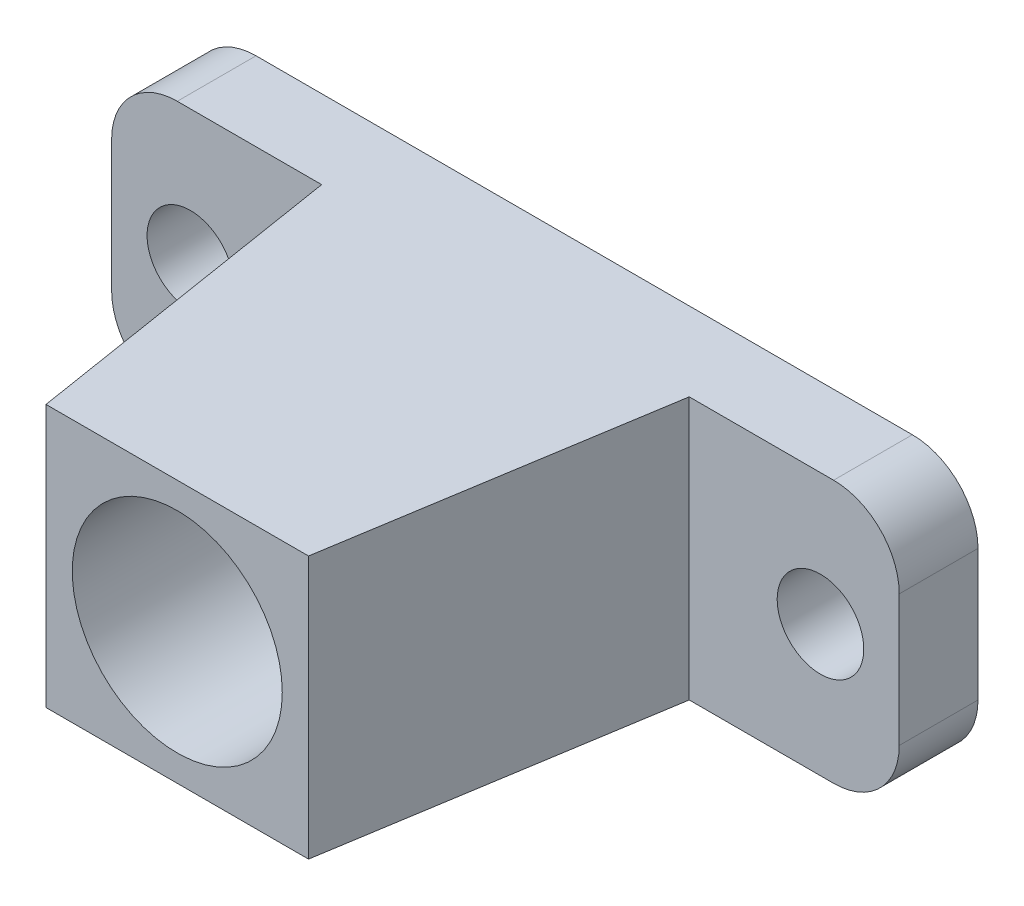
ISO-10303-21;
HEADER;
FILE_DESCRIPTION(('STEP AP214'),'2;1');
FILE_NAME('part.step','',(''),(''),'','','');
FILE_SCHEMA(('AUTOMOTIVE_DESIGN { 1 0 10303 214 1 1 1 1 }'));
ENDSEC;
DATA;
#1=APPLICATION_CONTEXT('core data for automotive mechanical design processes');
#2=APPLICATION_PROTOCOL_DEFINITION('international standard','automotive_design',2000,#1);
#3=PRODUCT_CONTEXT('',#1,'mechanical');
#4=PRODUCT('Part','Part','',(#3));
#5=PRODUCT_RELATED_PRODUCT_CATEGORY('part','',(#4));
#6=PRODUCT_DEFINITION_FORMATION('','',#4);
#7=PRODUCT_DEFINITION_CONTEXT('part definition',#1,'design');
#8=PRODUCT_DEFINITION('design','',#6,#7);
#9=PRODUCT_DEFINITION_SHAPE('','',#8);
#10=(LENGTH_UNIT() NAMED_UNIT(*) SI_UNIT(.MILLI.,.METRE.));
#11=(NAMED_UNIT(*) PLANE_ANGLE_UNIT() SI_UNIT($,.RADIAN.));
#12=(NAMED_UNIT(*) SI_UNIT($,.STERADIAN.) SOLID_ANGLE_UNIT());
#13=UNCERTAINTY_MEASURE_WITH_UNIT(LENGTH_MEASURE(1.E-05),#10,'distance_accuracy_value','');
#14=(GEOMETRIC_REPRESENTATION_CONTEXT(3) GLOBAL_UNCERTAINTY_ASSIGNED_CONTEXT((#13)) GLOBAL_UNIT_ASSIGNED_CONTEXT((#10,
#11,#12)) REPRESENTATION_CONTEXT('',''));
#15=CARTESIAN_POINT('',(0.,0.,0.));
#16=DIRECTION('',(0.,0.,1.));
#17=DIRECTION('',(1.,0.,0.));
#18=AXIS2_PLACEMENT_3D('',#15,#16,#17);
#19=CARTESIAN_POINT('',(25.,5.,6.));
#20=DIRECTION('',(0.,0.,-1.));
#21=DIRECTION('',(-1.,0.,0.));
#22=AXIS2_PLACEMENT_3D('',#19,#20,#21);
#23=PLANE('',#22);
#24=CARTESIAN_POINT('',(24.,0.,6.));
#25=DIRECTION('',(0.,0.,1.));
#26=DIRECTION('',(-1.,0.,0.));
#27=AXIS2_PLACEMENT_3D('',#24,#25,#26);
#28=CIRCLE('',#27,3.3);
#29=CARTESIAN_POINT('',(20.7,0.,6.));
#30=VERTEX_POINT('',#29);
#31=EDGE_CURVE('E166',#30,#30,#28,.T.);
#32=ORIENTED_EDGE('',*,*,#31,.F.);
#33=EDGE_LOOP('',(#32));
#34=FACE_BOUND('',#33,.T.);
#35=DIRECTION('',(0.,1.,0.));
#36=VECTOR('',#35,1.);
#37=CARTESIAN_POINT('',(14.,-47.5366487582469,6.));
#38=LINE('',#37,#36);
#39=CARTESIAN_POINT('',(14.,-10.,6.));
#40=VERTEX_POINT('',#39);
#41=CARTESIAN_POINT('',(14.,10.,6.));
#42=VERTEX_POINT('',#41);
#43=EDGE_CURVE('E50',#40,#42,#38,.T.);
#44=ORIENTED_EDGE('',*,*,#43,.F.);
#45=DIRECTION('',(1.,0.,0.));
#46=VECTOR('',#45,1.);
#47=CARTESIAN_POINT('',(25.,-10.,6.));
#48=LINE('',#47,#46);
#49=CARTESIAN_POINT('',(25.,-10.,6.));
#50=VERTEX_POINT('',#49);
#51=EDGE_CURVE('E190',#40,#50,#48,.T.);
#52=ORIENTED_EDGE('',*,*,#51,.T.);
#53=CARTESIAN_POINT('',(25.,-5.,6.));
#54=DIRECTION('',(0.,0.,1.));
#55=DIRECTION('',(-1.,0.,0.));
#56=AXIS2_PLACEMENT_3D('',#53,#54,#55);
#57=CIRCLE('',#56,5.);
#58=CARTESIAN_POINT('',(30.,-5.,6.));
#59=VERTEX_POINT('',#58);
#60=EDGE_CURVE('E192',#50,#59,#57,.T.);
#61=ORIENTED_EDGE('',*,*,#60,.T.);
#62=DIRECTION('',(0.,1.,0.));
#63=VECTOR('',#62,1.);
#64=CARTESIAN_POINT('',(30.,5.,6.));
#65=LINE('',#64,#63);
#66=CARTESIAN_POINT('',(30.,5.,6.));
#67=VERTEX_POINT('',#66);
#68=EDGE_CURVE('E194',#59,#67,#65,.T.);
#69=ORIENTED_EDGE('',*,*,#68,.T.);
#70=CARTESIAN_POINT('',(25.,5.,6.));
#71=DIRECTION('',(0.,0.,1.));
#72=DIRECTION('',(-1.,0.,0.));
#73=AXIS2_PLACEMENT_3D('',#70,#71,#72);
#74=CIRCLE('',#73,5.);
#75=CARTESIAN_POINT('',(25.,10.,6.));
#76=VERTEX_POINT('',#75);
#77=EDGE_CURVE('E178',#67,#76,#74,.T.);
#78=ORIENTED_EDGE('',*,*,#77,.T.);
#79=DIRECTION('',(-1.,0.,0.));
#80=VECTOR('',#79,1.);
#81=CARTESIAN_POINT('',(25.,10.,6.));
#82=LINE('',#81,#80);
#83=EDGE_CURVE('E182',#76,#42,#82,.T.);
#84=ORIENTED_EDGE('',*,*,#83,.T.);
#85=EDGE_LOOP('',(#44,#52,#61,#69,#78,#84));
#86=FACE_BOUND('',#85,.T.);
#87=ADVANCED_FACE('F35',(#34,#86),#23,.F.);
#88=CARTESIAN_POINT('',(-25.,-10.,6.));
#89=VERTEX_POINT('',#88);
#90=CARTESIAN_POINT('',(-14.,-10.,6.));
#91=VERTEX_POINT('',#90);
#92=EDGE_CURVE('E58',#89,#91,#48,.T.);
#93=ORIENTED_EDGE('',*,*,#92,.T.);
#94=DIRECTION('',(0.,1.,0.));
#95=VECTOR('',#94,1.);
#96=CARTESIAN_POINT('',(-14.,-47.5366487582469,6.));
#97=LINE('',#96,#95);
#98=CARTESIAN_POINT('',(-14.,10.,6.));
#99=VERTEX_POINT('',#98);
#100=EDGE_CURVE('E158',#91,#99,#97,.T.);
#101=ORIENTED_EDGE('',*,*,#100,.T.);
#102=CARTESIAN_POINT('',(-25.,9.99999999999999,6.));
#103=VERTEX_POINT('',#102);
#104=EDGE_CURVE('E148',#99,#103,#82,.T.);
#105=ORIENTED_EDGE('',*,*,#104,.T.);
#106=CARTESIAN_POINT('',(-25.,5.,6.));
#107=DIRECTION('',(0.,0.,1.));
#108=DIRECTION('',(1.,0.,0.));
#109=AXIS2_PLACEMENT_3D('',#106,#107,#108);
#110=CIRCLE('',#109,5.);
#111=CARTESIAN_POINT('',(-30.,4.99999999999999,6.));
#112=VERTEX_POINT('',#111);
#113=EDGE_CURVE('E184',#103,#112,#110,.T.);
#114=ORIENTED_EDGE('',*,*,#113,.T.);
#115=DIRECTION('',(0.,-1.,0.));
#116=VECTOR('',#115,1.);
#117=CARTESIAN_POINT('',(-30.,4.99999999999999,6.));
#118=LINE('',#117,#116);
#119=CARTESIAN_POINT('',(-30.,-5.00000000000001,6.));
#120=VERTEX_POINT('',#119);
#121=EDGE_CURVE('E186',#112,#120,#118,.T.);
#122=ORIENTED_EDGE('',*,*,#121,.T.);
#123=CARTESIAN_POINT('',(-25.,-5.,6.));
#124=DIRECTION('',(0.,0.,1.));
#125=DIRECTION('',(-1.,0.,0.));
#126=AXIS2_PLACEMENT_3D('',#123,#124,#125);
#127=CIRCLE('',#126,5.);
#128=EDGE_CURVE('E188',#120,#89,#127,.T.);
#129=ORIENTED_EDGE('',*,*,#128,.T.);
#130=EDGE_LOOP('',(#93,#101,#105,#114,#122,#129));
#131=FACE_BOUND('',#130,.T.);
#132=CARTESIAN_POINT('',(-24.,0.,6.));
#133=DIRECTION('',(0.,0.,1.));
#134=DIRECTION('',(1.,0.,0.));
#135=AXIS2_PLACEMENT_3D('',#132,#133,#134);
#136=CIRCLE('',#135,3.3);
#137=CARTESIAN_POINT('',(-20.7,0.,6.));
#138=VERTEX_POINT('',#137);
#139=EDGE_CURVE('E172',#138,#138,#136,.T.);
#140=ORIENTED_EDGE('',*,*,#139,.F.);
#141=EDGE_LOOP('',(#140));
#142=FACE_BOUND('',#141,.T.);
#143=ADVANCED_FACE('F249',(#131,#142),#23,.F.);
#144=CARTESIAN_POINT('',(25.,5.,0.));
#145=DIRECTION('',(0.,0.,-1.));
#146=DIRECTION('',(-1.,0.,0.));
#147=AXIS2_PLACEMENT_3D('',#144,#145,#146);
#148=PLANE('',#147);
#149=CARTESIAN_POINT('',(0.,0.,0.));
#150=DIRECTION('',(0.,0.,1.));
#151=DIRECTION('',(1.,0.,0.));
#152=AXIS2_PLACEMENT_3D('',#149,#150,#151);
#153=CIRCLE('',#152,8.);
#154=CARTESIAN_POINT('',(8.,0.,0.));
#155=VERTEX_POINT('',#154);
#156=EDGE_CURVE('E149',#155,#155,#153,.T.);
#157=ORIENTED_EDGE('',*,*,#156,.T.);
#158=EDGE_LOOP('',(#157));
#159=FACE_BOUND('',#158,.T.);
#160=CARTESIAN_POINT('',(-24.,0.,0.));
#161=DIRECTION('',(0.,0.,1.));
#162=DIRECTION('',(1.,0.,0.));
#163=AXIS2_PLACEMENT_3D('',#160,#161,#162);
#164=CIRCLE('',#163,3.3);
#165=CARTESIAN_POINT('',(-20.7,0.,0.));
#166=VERTEX_POINT('',#165);
#167=EDGE_CURVE('E169',#166,#166,#164,.T.);
#168=ORIENTED_EDGE('',*,*,#167,.T.);
#169=EDGE_LOOP('',(#168));
#170=FACE_BOUND('',#169,.T.);
#171=CARTESIAN_POINT('',(25.,5.,0.));
#172=DIRECTION('',(0.,0.,1.));
#173=DIRECTION('',(-1.,0.,0.));
#174=AXIS2_PLACEMENT_3D('',#171,#172,#173);
#175=CIRCLE('',#174,5.);
#176=CARTESIAN_POINT('',(30.,5.,0.));
#177=VERTEX_POINT('',#176);
#178=CARTESIAN_POINT('',(25.,10.,0.));
#179=VERTEX_POINT('',#178);
#180=EDGE_CURVE('E175',#177,#179,#175,.T.);
#181=ORIENTED_EDGE('',*,*,#180,.F.);
#182=DIRECTION('',(0.,1.,0.));
#183=VECTOR('',#182,1.);
#184=CARTESIAN_POINT('',(30.,5.,0.));
#185=LINE('',#184,#183);
#186=CARTESIAN_POINT('',(30.,-5.,0.));
#187=VERTEX_POINT('',#186);
#188=EDGE_CURVE('E181',#187,#177,#185,.T.);
#189=ORIENTED_EDGE('',*,*,#188,.F.);
#190=CARTESIAN_POINT('',(25.,-5.,0.));
#191=DIRECTION('',(0.,0.,1.));
#192=DIRECTION('',(-1.,0.,0.));
#193=AXIS2_PLACEMENT_3D('',#190,#191,#192);
#194=CIRCLE('',#193,5.);
#195=CARTESIAN_POINT('',(25.,-10.,0.));
#196=VERTEX_POINT('',#195);
#197=EDGE_CURVE('E209',#196,#187,#194,.T.);
#198=ORIENTED_EDGE('',*,*,#197,.F.);
#199=DIRECTION('',(1.,0.,0.));
#200=VECTOR('',#199,1.);
#201=CARTESIAN_POINT('',(25.,-10.,0.));
#202=LINE('',#201,#200);
#203=CARTESIAN_POINT('',(-25.,-10.,0.));
#204=VERTEX_POINT('',#203);
#205=EDGE_CURVE('E207',#204,#196,#202,.T.);
#206=ORIENTED_EDGE('',*,*,#205,.F.);
#207=CARTESIAN_POINT('',(-25.,-5.,0.));
#208=DIRECTION('',(0.,0.,1.));
#209=DIRECTION('',(-1.,0.,0.));
#210=AXIS2_PLACEMENT_3D('',#207,#208,#209);
#211=CIRCLE('',#210,5.);
#212=CARTESIAN_POINT('',(-30.,-5.00000000000001,0.));
#213=VERTEX_POINT('',#212);
#214=EDGE_CURVE('E205',#213,#204,#211,.T.);
#215=ORIENTED_EDGE('',*,*,#214,.F.);
#216=DIRECTION('',(0.,-1.,0.));
#217=VECTOR('',#216,1.);
#218=CARTESIAN_POINT('',(-30.,4.99999999999999,0.));
#219=LINE('',#218,#217);
#220=CARTESIAN_POINT('',(-30.,4.99999999999999,0.));
#221=VERTEX_POINT('',#220);
#222=EDGE_CURVE('E203',#221,#213,#219,.T.);
#223=ORIENTED_EDGE('',*,*,#222,.F.);
#224=CARTESIAN_POINT('',(-25.,5.,0.));
#225=DIRECTION('',(0.,0.,1.));
#226=DIRECTION('',(1.,0.,0.));
#227=AXIS2_PLACEMENT_3D('',#224,#225,#226);
#228=CIRCLE('',#227,5.);
#229=CARTESIAN_POINT('',(-25.,9.99999999999999,0.));
#230=VERTEX_POINT('',#229);
#231=EDGE_CURVE('E201',#230,#221,#228,.T.);
#232=ORIENTED_EDGE('',*,*,#231,.F.);
#233=DIRECTION('',(-1.,0.,0.));
#234=VECTOR('',#233,1.);
#235=CARTESIAN_POINT('',(25.,10.,0.));
#236=LINE('',#235,#234);
#237=EDGE_CURVE('E199',#179,#230,#236,.T.);
#238=ORIENTED_EDGE('',*,*,#237,.F.);
#239=EDGE_LOOP('',(#181,#189,#198,#206,#215,#223,#232,#238));
#240=FACE_BOUND('',#239,.T.);
#241=CARTESIAN_POINT('',(24.,0.,0.));
#242=DIRECTION('',(0.,0.,1.));
#243=DIRECTION('',(-1.,0.,0.));
#244=AXIS2_PLACEMENT_3D('',#241,#242,#243);
#245=CIRCLE('',#244,3.3);
#246=CARTESIAN_POINT('',(20.7,0.,0.));
#247=VERTEX_POINT('',#246);
#248=EDGE_CURVE('E165',#247,#247,#245,.T.);
#249=ORIENTED_EDGE('',*,*,#248,.T.);
#250=EDGE_LOOP('',(#249));
#251=FACE_BOUND('',#250,.T.);
#252=ADVANCED_FACE('F237',(#159,#170,#240,#251),#148,.T.);
#253=CARTESIAN_POINT('',(25.,5.,6.));
#254=DIRECTION('',(0.,0.,-1.));
#255=DIRECTION('',(-1.,0.,0.));
#256=AXIS2_PLACEMENT_3D('',#253,#254,#255);
#257=CYLINDRICAL_SURFACE('',#256,5.);
#258=ORIENTED_EDGE('',*,*,#180,.T.);
#259=DIRECTION('',(0.,0.,-1.));
#260=VECTOR('',#259,1.);
#261=CARTESIAN_POINT('',(25.,10.,6.));
#262=LINE('',#261,#260);
#263=EDGE_CURVE('E11',#76,#179,#262,.T.);
#264=ORIENTED_EDGE('',*,*,#263,.F.);
#265=ORIENTED_EDGE('',*,*,#77,.F.);
#266=DIRECTION('',(0.,0.,-1.));
#267=VECTOR('',#266,1.);
#268=CARTESIAN_POINT('',(30.,5.,6.));
#269=LINE('',#268,#267);
#270=EDGE_CURVE('E196',#67,#177,#269,.T.);
#271=ORIENTED_EDGE('',*,*,#270,.T.);
#272=EDGE_LOOP('',(#258,#264,#265,#271));
#273=FACE_BOUND('',#272,.T.);
#274=ADVANCED_FACE('F37',(#273),#257,.T.);
#275=CARTESIAN_POINT('',(25.,10.,6.));
#276=DIRECTION('',(0.,-1.,0.));
#277=DIRECTION('',(1.,0.,0.));
#278=AXIS2_PLACEMENT_3D('',#275,#276,#277);
#279=PLANE('',#278);
#280=ORIENTED_EDGE('',*,*,#237,.T.);
#281=DIRECTION('',(0.,0.,-1.));
#282=VECTOR('',#281,1.);
#283=CARTESIAN_POINT('',(-25.,9.99999999999999,6.));
#284=LINE('',#283,#282);
#285=EDGE_CURVE('E43',#103,#230,#284,.T.);
#286=ORIENTED_EDGE('',*,*,#285,.F.);
#287=ORIENTED_EDGE('',*,*,#104,.F.);
#288=DIRECTION('',(0.157990501106673,0.,0.987440631916705));
#289=VECTOR('',#288,1.);
#290=CARTESIAN_POINT('',(-14.,10.,6.));
#291=LINE('',#290,#289);
#292=CARTESIAN_POINT('',(-10.,10.,31.));
#293=VERTEX_POINT('',#292);
#294=EDGE_CURVE('E130',#99,#293,#291,.T.);
#295=ORIENTED_EDGE('',*,*,#294,.T.);
#296=DIRECTION('',(1.,0.,0.));
#297=VECTOR('',#296,1.);
#298=CARTESIAN_POINT('',(-10.,10.,31.));
#299=LINE('',#298,#297);
#300=CARTESIAN_POINT('',(10.,10.,31.));
#301=VERTEX_POINT('',#300);
#302=EDGE_CURVE('E138',#293,#301,#299,.T.);
#303=ORIENTED_EDGE('',*,*,#302,.T.);
#304=DIRECTION('',(0.157990501106673,0.,-0.987440631916705));
#305=VECTOR('',#304,1.);
#306=CARTESIAN_POINT('',(14.,10.,6.));
#307=LINE('',#306,#305);
#308=EDGE_CURVE('E135',#301,#42,#307,.T.);
#309=ORIENTED_EDGE('',*,*,#308,.T.);
#310=ORIENTED_EDGE('',*,*,#83,.F.);
#311=ORIENTED_EDGE('',*,*,#263,.T.);
#312=EDGE_LOOP('',(#280,#286,#287,#295,#303,#309,#310,#311));
#313=FACE_BOUND('',#312,.T.);
#314=ADVANCED_FACE('F146',(#313),#279,.F.);
#315=CARTESIAN_POINT('',(-25.,5.,6.));
#316=DIRECTION('',(0.,0.,-1.));
#317=DIRECTION('',(-1.,0.,0.));
#318=AXIS2_PLACEMENT_3D('',#315,#316,#317);
#319=CYLINDRICAL_SURFACE('',#318,5.);
#320=ORIENTED_EDGE('',*,*,#231,.T.);
#321=DIRECTION('',(0.,0.,-1.));
#322=VECTOR('',#321,1.);
#323=CARTESIAN_POINT('',(-30.,4.99999999999999,6.));
#324=LINE('',#323,#322);
#325=EDGE_CURVE('E226',#112,#221,#324,.T.);
#326=ORIENTED_EDGE('',*,*,#325,.F.);
#327=ORIENTED_EDGE('',*,*,#113,.F.);
#328=ORIENTED_EDGE('',*,*,#285,.T.);
#329=EDGE_LOOP('',(#320,#326,#327,#328));
#330=FACE_BOUND('',#329,.T.);
#331=ADVANCED_FACE('F232',(#330),#319,.T.);
#332=CARTESIAN_POINT('',(-30.,4.99999999999999,6.));
#333=DIRECTION('',(1.,0.,0.));
#334=DIRECTION('',(0.,1.,0.));
#335=AXIS2_PLACEMENT_3D('',#332,#333,#334);
#336=PLANE('',#335);
#337=ORIENTED_EDGE('',*,*,#222,.T.);
#338=DIRECTION('',(0.,0.,-1.));
#339=VECTOR('',#338,1.);
#340=CARTESIAN_POINT('',(-30.,-5.00000000000001,6.));
#341=LINE('',#340,#339);
#342=EDGE_CURVE('E223',#120,#213,#341,.T.);
#343=ORIENTED_EDGE('',*,*,#342,.F.);
#344=ORIENTED_EDGE('',*,*,#121,.F.);
#345=ORIENTED_EDGE('',*,*,#325,.T.);
#346=EDGE_LOOP('',(#337,#343,#344,#345));
#347=FACE_BOUND('',#346,.T.);
#348=ADVANCED_FACE('F243',(#347),#336,.F.);
#349=CARTESIAN_POINT('',(-25.,-5.,6.));
#350=DIRECTION('',(0.,0.,-1.));
#351=DIRECTION('',(-1.,0.,0.));
#352=AXIS2_PLACEMENT_3D('',#349,#350,#351);
#353=CYLINDRICAL_SURFACE('',#352,5.);
#354=ORIENTED_EDGE('',*,*,#214,.T.);
#355=DIRECTION('',(0.,0.,-1.));
#356=VECTOR('',#355,1.);
#357=CARTESIAN_POINT('',(-25.,-10.,6.));
#358=LINE('',#357,#356);
#359=EDGE_CURVE('E220',#89,#204,#358,.T.);
#360=ORIENTED_EDGE('',*,*,#359,.F.);
#361=ORIENTED_EDGE('',*,*,#128,.F.);
#362=ORIENTED_EDGE('',*,*,#342,.T.);
#363=EDGE_LOOP('',(#354,#360,#361,#362));
#364=FACE_BOUND('',#363,.T.);
#365=ADVANCED_FACE('F247',(#364),#353,.T.);
#366=CARTESIAN_POINT('',(25.,-10.,6.));
#367=DIRECTION('',(0.,1.,0.));
#368=DIRECTION('',(-1.,0.,0.));
#369=AXIS2_PLACEMENT_3D('',#366,#367,#368);
#370=PLANE('',#369);
#371=ORIENTED_EDGE('',*,*,#205,.T.);
#372=DIRECTION('',(0.,0.,-1.));
#373=VECTOR('',#372,1.);
#374=CARTESIAN_POINT('',(25.,-10.,6.));
#375=LINE('',#374,#373);
#376=EDGE_CURVE('E217',#50,#196,#375,.T.);
#377=ORIENTED_EDGE('',*,*,#376,.F.);
#378=ORIENTED_EDGE('',*,*,#51,.F.);
#379=DIRECTION('',(-0.157990501106673,0.,0.987440631916705));
#380=VECTOR('',#379,1.);
#381=CARTESIAN_POINT('',(14.,-10.,6.));
#382=LINE('',#381,#380);
#383=CARTESIAN_POINT('',(10.,-10.,31.));
#384=VERTEX_POINT('',#383);
#385=EDGE_CURVE('E160',#40,#384,#382,.T.);
#386=ORIENTED_EDGE('',*,*,#385,.T.);
#387=DIRECTION('',(-1.,0.,0.));
#388=VECTOR('',#387,1.);
#389=CARTESIAN_POINT('',(-10.,-10.,31.));
#390=LINE('',#389,#388);
#391=CARTESIAN_POINT('',(-10.,-10.,31.));
#392=VERTEX_POINT('',#391);
#393=EDGE_CURVE('E163',#384,#392,#390,.T.);
#394=ORIENTED_EDGE('',*,*,#393,.T.);
#395=DIRECTION('',(-0.157990501106673,0.,-0.987440631916705));
#396=VECTOR('',#395,1.);
#397=CARTESIAN_POINT('',(-14.,-10.,6.));
#398=LINE('',#397,#396);
#399=EDGE_CURVE('E131',#392,#91,#398,.T.);
#400=ORIENTED_EDGE('',*,*,#399,.T.);
#401=ORIENTED_EDGE('',*,*,#92,.F.);
#402=ORIENTED_EDGE('',*,*,#359,.T.);
#403=EDGE_LOOP('',(#371,#377,#378,#386,#394,#400,#401,#402));
#404=FACE_BOUND('',#403,.T.);
#405=ADVANCED_FACE('F301',(#404),#370,.F.);
#406=CARTESIAN_POINT('',(25.,-5.,6.));
#407=DIRECTION('',(0.,0.,-1.));
#408=DIRECTION('',(-1.,0.,0.));
#409=AXIS2_PLACEMENT_3D('',#406,#407,#408);
#410=CYLINDRICAL_SURFACE('',#409,5.);
#411=ORIENTED_EDGE('',*,*,#197,.T.);
#412=DIRECTION('',(0.,0.,-1.));
#413=VECTOR('',#412,1.);
#414=CARTESIAN_POINT('',(30.,-5.,6.));
#415=LINE('',#414,#413);
#416=EDGE_CURVE('E214',#59,#187,#415,.T.);
#417=ORIENTED_EDGE('',*,*,#416,.F.);
#418=ORIENTED_EDGE('',*,*,#60,.F.);
#419=ORIENTED_EDGE('',*,*,#376,.T.);
#420=EDGE_LOOP('',(#411,#417,#418,#419));
#421=FACE_BOUND('',#420,.T.);
#422=ADVANCED_FACE('F307',(#421),#410,.T.);
#423=CARTESIAN_POINT('',(30.,5.,6.));
#424=DIRECTION('',(-1.,0.,0.));
#425=DIRECTION('',(0.,0.,1.));
#426=AXIS2_PLACEMENT_3D('',#423,#424,#425);
#427=PLANE('',#426);
#428=ORIENTED_EDGE('',*,*,#188,.T.);
#429=ORIENTED_EDGE('',*,*,#270,.F.);
#430=ORIENTED_EDGE('',*,*,#68,.F.);
#431=ORIENTED_EDGE('',*,*,#416,.T.);
#432=EDGE_LOOP('',(#428,#429,#430,#431));
#433=FACE_BOUND('',#432,.T.);
#434=ADVANCED_FACE('F259',(#433),#427,.F.);
#435=CARTESIAN_POINT('',(-24.,0.,6.));
#436=DIRECTION('',(0.,0.,-1.));
#437=DIRECTION('',(-1.,0.,0.));
#438=AXIS2_PLACEMENT_3D('',#435,#436,#437);
#439=CYLINDRICAL_SURFACE('',#438,3.3);
#440=ORIENTED_EDGE('',*,*,#139,.T.);
#441=EDGE_LOOP('',(#440));
#442=FACE_BOUND('',#441,.T.);
#443=ORIENTED_EDGE('',*,*,#167,.F.);
#444=EDGE_LOOP('',(#443));
#445=FACE_BOUND('',#444,.T.);
#446=ADVANCED_FACE('F255',(#442,#445),#439,.F.);
#447=CARTESIAN_POINT('',(24.,0.,6.));
#448=DIRECTION('',(0.,0.,-1.));
#449=DIRECTION('',(-1.,0.,0.));
#450=AXIS2_PLACEMENT_3D('',#447,#448,#449);
#451=CYLINDRICAL_SURFACE('',#450,3.3);
#452=ORIENTED_EDGE('',*,*,#31,.T.);
#453=EDGE_LOOP('',(#452));
#454=FACE_BOUND('',#453,.T.);
#455=ORIENTED_EDGE('',*,*,#248,.F.);
#456=EDGE_LOOP('',(#455));
#457=FACE_BOUND('',#456,.T.);
#458=ADVANCED_FACE('F258',(#454,#457),#451,.F.);
#459=CARTESIAN_POINT('',(-14.,-47.5366487582469,6.));
#460=DIRECTION('',(-0.987440631916705,0.,0.157990501106673));
#461=DIRECTION('',(0.157990501106673,0.,0.987440631916705));
#462=AXIS2_PLACEMENT_3D('',#459,#460,#461);
#463=PLANE('',#462);
#464=ORIENTED_EDGE('',*,*,#399,.F.);
#465=DIRECTION('',(0.,1.,0.));
#466=VECTOR('',#465,1.);
#467=CARTESIAN_POINT('',(-9.99999999999999,-47.5366487582469,31.));
#468=LINE('',#467,#466);
#469=EDGE_CURVE('E125',#392,#293,#468,.T.);
#470=ORIENTED_EDGE('',*,*,#469,.T.);
#471=ORIENTED_EDGE('',*,*,#294,.F.);
#472=ORIENTED_EDGE('',*,*,#100,.F.);
#473=EDGE_LOOP('',(#464,#470,#471,#472));
#474=FACE_BOUND('',#473,.T.);
#475=ADVANCED_FACE('F127',(#474),#463,.T.);
#476=CARTESIAN_POINT('',(14.,-47.5366487582469,6.));
#477=DIRECTION('',(0.987440631916705,0.,0.157990501106673));
#478=DIRECTION('',(0.157990501106673,0.,-0.987440631916705));
#479=AXIS2_PLACEMENT_3D('',#476,#477,#478);
#480=PLANE('',#479);
#481=ORIENTED_EDGE('',*,*,#385,.F.);
#482=ORIENTED_EDGE('',*,*,#43,.T.);
#483=ORIENTED_EDGE('',*,*,#308,.F.);
#484=DIRECTION('',(0.,1.,0.));
#485=VECTOR('',#484,1.);
#486=CARTESIAN_POINT('',(10.,-47.5366487582469,31.));
#487=LINE('',#486,#485);
#488=EDGE_CURVE('E134',#384,#301,#487,.T.);
#489=ORIENTED_EDGE('',*,*,#488,.F.);
#490=EDGE_LOOP('',(#481,#482,#483,#489));
#491=FACE_BOUND('',#490,.T.);
#492=ADVANCED_FACE('F282',(#491),#480,.T.);
#493=CARTESIAN_POINT('',(-9.99999999999999,-47.5366487582469,31.));
#494=DIRECTION('',(0.,0.,1.));
#495=DIRECTION('',(1.,0.,0.));
#496=AXIS2_PLACEMENT_3D('',#493,#494,#495);
#497=PLANE('',#496);
#498=CARTESIAN_POINT('',(0.,0.,31.));
#499=DIRECTION('',(0.,0.,1.));
#500=DIRECTION('',(1.,0.,0.));
#501=AXIS2_PLACEMENT_3D('',#498,#499,#500);
#502=CIRCLE('',#501,8.);
#503=CARTESIAN_POINT('',(8.,0.,31.));
#504=VERTEX_POINT('',#503);
#505=EDGE_CURVE('E152',#504,#504,#502,.T.);
#506=ORIENTED_EDGE('',*,*,#505,.F.);
#507=EDGE_LOOP('',(#506));
#508=FACE_BOUND('',#507,.T.);
#509=ORIENTED_EDGE('',*,*,#393,.F.);
#510=ORIENTED_EDGE('',*,*,#488,.T.);
#511=ORIENTED_EDGE('',*,*,#302,.F.);
#512=ORIENTED_EDGE('',*,*,#469,.F.);
#513=EDGE_LOOP('',(#509,#510,#511,#512));
#514=FACE_BOUND('',#513,.T.);
#515=ADVANCED_FACE('F139',(#508,#514),#497,.T.);
#516=CARTESIAN_POINT('',(0.,0.,0.));
#517=DIRECTION('',(0.,0.,1.));
#518=DIRECTION('',(1.,0.,0.));
#519=AXIS2_PLACEMENT_3D('',#516,#517,#518);
#520=CYLINDRICAL_SURFACE('',#519,8.);
#521=ORIENTED_EDGE('',*,*,#156,.F.);
#522=EDGE_LOOP('',(#521));
#523=FACE_BOUND('',#522,.T.);
#524=ORIENTED_EDGE('',*,*,#505,.T.);
#525=EDGE_LOOP('',(#524));
#526=FACE_BOUND('',#525,.T.);
#527=ADVANCED_FACE('F285',(#523,#526),#520,.F.);
#528=CLOSED_SHELL('',(#87,#143,#252,#274,#314,#331,#348,#365,#405,#422,#434,#446,#458,#475,#492,
#515,#527));
#529=MANIFOLD_SOLID_BREP('B2',#528);
#530=ADVANCED_BREP_SHAPE_REPRESENTATION('',(#18,#529),#14);
#531=SHAPE_DEFINITION_REPRESENTATION(#9,#530);
ENDSEC;
END-ISO-10303-21;
